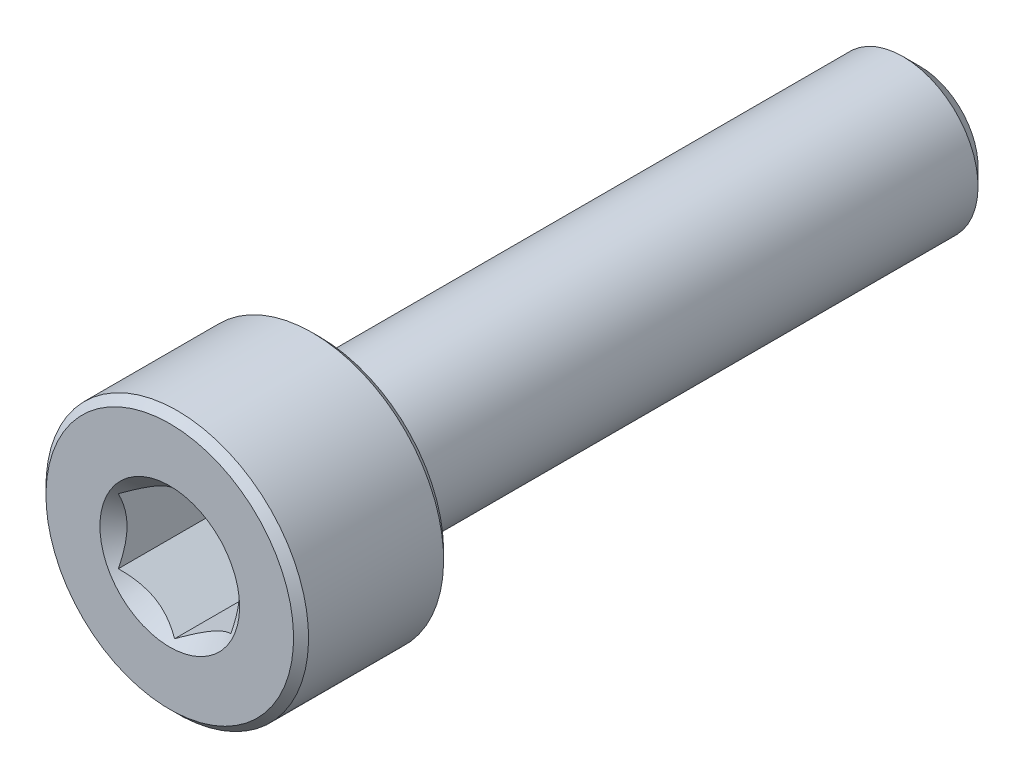
ISO-10303-21;
HEADER;
FILE_DESCRIPTION(('STEP AP214'),'2;1');
FILE_NAME('part.step','',(''),(''),'','','');
FILE_SCHEMA(('AUTOMOTIVE_DESIGN { 1 0 10303 214 1 1 1 1 }'));
ENDSEC;
DATA;
#1=APPLICATION_CONTEXT('core data for automotive mechanical design processes');
#2=APPLICATION_PROTOCOL_DEFINITION('international standard','automotive_design',2000,#1);
#3=PRODUCT_CONTEXT('',#1,'mechanical');
#4=PRODUCT('Part','Part','',(#3));
#5=PRODUCT_RELATED_PRODUCT_CATEGORY('part','',(#4));
#6=PRODUCT_DEFINITION_FORMATION('','',#4);
#7=PRODUCT_DEFINITION_CONTEXT('part definition',#1,'design');
#8=PRODUCT_DEFINITION('design','',#6,#7);
#9=PRODUCT_DEFINITION_SHAPE('','',#8);
#10=(LENGTH_UNIT() NAMED_UNIT(*) SI_UNIT(.MILLI.,.METRE.));
#11=(NAMED_UNIT(*) PLANE_ANGLE_UNIT() SI_UNIT($,.RADIAN.));
#12=(NAMED_UNIT(*) SI_UNIT($,.STERADIAN.) SOLID_ANGLE_UNIT());
#13=UNCERTAINTY_MEASURE_WITH_UNIT(LENGTH_MEASURE(1.E-05),#10,'distance_accuracy_value','');
#14=(GEOMETRIC_REPRESENTATION_CONTEXT(3) GLOBAL_UNCERTAINTY_ASSIGNED_CONTEXT((#13)) GLOBAL_UNIT_ASSIGNED_CONTEXT((#10,
#11,#12)) REPRESENTATION_CONTEXT('',''));
#15=CARTESIAN_POINT('',(0.,0.,0.));
#16=DIRECTION('',(0.,0.,1.));
#17=DIRECTION('',(1.,0.,0.));
#18=AXIS2_PLACEMENT_3D('',#15,#16,#17);
#19=CARTESIAN_POINT('',(0.,1.54533666301317,-10.));
#20=DIRECTION('',(0.,0.,-1.));
#21=DIRECTION('',(0.,1.,0.));
#22=AXIS2_PLACEMENT_3D('',#19,#20,#21);
#23=PLANE('',#22);
#24=CARTESIAN_POINT('',(0.,0.,-10.));
#25=DIRECTION('',(0.,0.,-1.));
#26=DIRECTION('',(0.,1.,0.));
#27=AXIS2_PLACEMENT_3D('',#24,#25,#26);
#28=CIRCLE('',#27,1.54533666301317);
#29=CARTESIAN_POINT('',(0.,1.54533666301317,-10.));
#30=VERTEX_POINT('',#29);
#31=EDGE_CURVE('E49',#30,#30,#28,.T.);
#32=ORIENTED_EDGE('',*,*,#31,.T.);
#33=EDGE_LOOP('',(#32));
#34=FACE_BOUND('',#33,.T.);
#35=ADVANCED_FACE('F36',(#34),#23,.T.);
#36=CARTESIAN_POINT('',(0.,0.,-10.));
#37=DIRECTION('',(0.,0.,1.));
#38=DIRECTION('',(0.,-1.,0.));
#39=AXIS2_PLACEMENT_3D('',#36,#37,#38);
#40=CONICAL_SURFACE('',#39,1.54533666301317,0.785398163397449);
#41=CARTESIAN_POINT('',(0.,0.,-9.54533666301317));
#42=DIRECTION('',(0.,0.,-1.));
#43=DIRECTION('',(0.,1.,0.));
#44=AXIS2_PLACEMENT_3D('',#41,#42,#43);
#45=CIRCLE('',#44,2.);
#46=CARTESIAN_POINT('',(0.,2.,-9.54533666301317));
#47=VERTEX_POINT('',#46);
#48=EDGE_CURVE('E152',#47,#47,#45,.T.);
#49=ORIENTED_EDGE('',*,*,#48,.T.);
#50=EDGE_LOOP('',(#49));
#51=FACE_BOUND('',#50,.T.);
#52=ORIENTED_EDGE('',*,*,#31,.F.);
#53=EDGE_LOOP('',(#52));
#54=FACE_BOUND('',#53,.T.);
#55=ADVANCED_FACE('F158',(#51,#54),#40,.T.);
#56=CARTESIAN_POINT('',(0.,0.,-10.));
#57=DIRECTION('',(0.,0.,-1.));
#58=DIRECTION('',(0.,1.,0.));
#59=AXIS2_PLACEMENT_3D('',#56,#57,#58);
#60=CYLINDRICAL_SURFACE('',#59,2.);
#61=CARTESIAN_POINT('',(0.,0.,5.8));
#62=DIRECTION('',(0.,0.,-1.));
#63=DIRECTION('',(0.,1.,0.));
#64=AXIS2_PLACEMENT_3D('',#61,#62,#63);
#65=CIRCLE('',#64,2.);
#66=CARTESIAN_POINT('',(0.,2.,5.8));
#67=VERTEX_POINT('',#66);
#68=EDGE_CURVE('E149',#67,#67,#65,.T.);
#69=ORIENTED_EDGE('',*,*,#68,.T.);
#70=EDGE_LOOP('',(#69));
#71=FACE_BOUND('',#70,.T.);
#72=ORIENTED_EDGE('',*,*,#48,.F.);
#73=EDGE_LOOP('',(#72));
#74=FACE_BOUND('',#73,.T.);
#75=ADVANCED_FACE('F160',(#71,#74),#60,.T.);
#76=CARTESIAN_POINT('',(0.,0.,5.8));
#77=DIRECTION('',(0.,0.,-1.));
#78=DIRECTION('',(0.,1.,0.));
#79=AXIS2_PLACEMENT_3D('',#76,#77,#78);
#80=TOROIDAL_SURFACE('',#79,2.2,0.2);
#81=CARTESIAN_POINT('',(0.,0.,6.));
#82=DIRECTION('',(0.,0.,-1.));
#83=DIRECTION('',(0.,1.,0.));
#84=AXIS2_PLACEMENT_3D('',#81,#82,#83);
#85=CIRCLE('',#84,2.2);
#86=CARTESIAN_POINT('',(0.,2.2,6.));
#87=VERTEX_POINT('',#86);
#88=EDGE_CURVE('E146',#87,#87,#85,.T.);
#89=ORIENTED_EDGE('',*,*,#88,.T.);
#90=EDGE_LOOP('',(#89));
#91=FACE_BOUND('',#90,.T.);
#92=ORIENTED_EDGE('',*,*,#68,.F.);
#93=EDGE_LOOP('',(#92));
#94=FACE_BOUND('',#93,.T.);
#95=ADVANCED_FACE('F166',(#91,#94),#80,.F.);
#96=CARTESIAN_POINT('',(0.,3.3,6.));
#97=DIRECTION('',(0.,0.,-1.));
#98=DIRECTION('',(0.,1.,0.));
#99=AXIS2_PLACEMENT_3D('',#96,#97,#98);
#100=PLANE('',#99);
#101=CARTESIAN_POINT('',(0.,0.,6.));
#102=DIRECTION('',(0.,0.,-1.));
#103=DIRECTION('',(0.,1.,0.));
#104=AXIS2_PLACEMENT_3D('',#101,#102,#103);
#105=CIRCLE('',#104,3.3);
#106=CARTESIAN_POINT('',(0.,3.3,6.));
#107=VERTEX_POINT('',#106);
#108=EDGE_CURVE('E143',#107,#107,#105,.T.);
#109=ORIENTED_EDGE('',*,*,#108,.T.);
#110=EDGE_LOOP('',(#109));
#111=FACE_BOUND('',#110,.T.);
#112=ORIENTED_EDGE('',*,*,#88,.F.);
#113=EDGE_LOOP('',(#112));
#114=FACE_BOUND('',#113,.T.);
#115=ADVANCED_FACE('F172',(#111,#114),#100,.T.);
#116=CARTESIAN_POINT('',(0.,0.,6.));
#117=DIRECTION('',(0.,0.,1.));
#118=DIRECTION('',(0.,-1.,0.));
#119=AXIS2_PLACEMENT_3D('',#116,#117,#118);
#120=CONICAL_SURFACE('',#119,3.3,0.785398163397452);
#121=CARTESIAN_POINT('',(0.,0.,6.2));
#122=DIRECTION('',(0.,0.,-1.));
#123=DIRECTION('',(0.,1.,0.));
#124=AXIS2_PLACEMENT_3D('',#121,#122,#123);
#125=CIRCLE('',#124,3.5);
#126=CARTESIAN_POINT('',(0.,3.5,6.2));
#127=VERTEX_POINT('',#126);
#128=EDGE_CURVE('E140',#127,#127,#125,.T.);
#129=ORIENTED_EDGE('',*,*,#128,.T.);
#130=EDGE_LOOP('',(#129));
#131=FACE_BOUND('',#130,.T.);
#132=ORIENTED_EDGE('',*,*,#108,.F.);
#133=EDGE_LOOP('',(#132));
#134=FACE_BOUND('',#133,.T.);
#135=ADVANCED_FACE('F176',(#131,#134),#120,.T.);
#136=CARTESIAN_POINT('',(0.,0.,-10.));
#137=DIRECTION('',(0.,0.,-1.));
#138=DIRECTION('',(0.,1.,0.));
#139=AXIS2_PLACEMENT_3D('',#136,#137,#138);
#140=CYLINDRICAL_SURFACE('',#139,3.5);
#141=CARTESIAN_POINT('',(0.,0.,9.8));
#142=DIRECTION('',(0.,0.,-1.));
#143=DIRECTION('',(0.,1.,0.));
#144=AXIS2_PLACEMENT_3D('',#141,#142,#143);
#145=CIRCLE('',#144,3.5);
#146=CARTESIAN_POINT('',(0.,3.5,9.8));
#147=VERTEX_POINT('',#146);
#148=EDGE_CURVE('E137',#147,#147,#145,.T.);
#149=ORIENTED_EDGE('',*,*,#148,.T.);
#150=EDGE_LOOP('',(#149));
#151=FACE_BOUND('',#150,.T.);
#152=ORIENTED_EDGE('',*,*,#128,.F.);
#153=EDGE_LOOP('',(#152));
#154=FACE_BOUND('',#153,.T.);
#155=ADVANCED_FACE('F180',(#151,#154),#140,.T.);
#156=CARTESIAN_POINT('',(0.,0.,9.8));
#157=DIRECTION('',(0.,0.,-1.));
#158=DIRECTION('',(0.,1.,0.));
#159=AXIS2_PLACEMENT_3D('',#156,#157,#158);
#160=CONICAL_SURFACE('',#159,3.5,0.785398163397443);
#161=CARTESIAN_POINT('',(0.,0.,10.));
#162=DIRECTION('',(0.,0.,-1.));
#163=DIRECTION('',(0.,1.,0.));
#164=AXIS2_PLACEMENT_3D('',#161,#162,#163);
#165=CIRCLE('',#164,3.3);
#166=CARTESIAN_POINT('',(0.,3.3,10.));
#167=VERTEX_POINT('',#166);
#168=EDGE_CURVE('E134',#167,#167,#165,.T.);
#169=ORIENTED_EDGE('',*,*,#168,.T.);
#170=EDGE_LOOP('',(#169));
#171=FACE_BOUND('',#170,.T.);
#172=ORIENTED_EDGE('',*,*,#148,.F.);
#173=EDGE_LOOP('',(#172));
#174=FACE_BOUND('',#173,.T.);
#175=ADVANCED_FACE('F184',(#171,#174),#160,.T.);
#176=CARTESIAN_POINT('',(0.,0.,10.));
#177=DIRECTION('',(0.,0.,1.));
#178=DIRECTION('',(0.,-1.,0.));
#179=AXIS2_PLACEMENT_3D('',#176,#177,#178);
#180=PLANE('',#179);
#181=CARTESIAN_POINT('',(0.,0.,10.));
#182=DIRECTION('',(0.,0.,1.));
#183=DIRECTION('',(1.,0.,0.));
#184=AXIS2_PLACEMENT_3D('',#181,#182,#183);
#185=CIRCLE('',#184,1.86195461813654);
#186=CARTESIAN_POINT('',(1.86195461813654,0.,10.));
#187=VERTEX_POINT('',#186);
#188=EDGE_CURVE('E108',#187,#187,#185,.T.);
#189=ORIENTED_EDGE('',*,*,#188,.F.);
#190=EDGE_LOOP('',(#189));
#191=FACE_BOUND('',#190,.T.);
#192=ORIENTED_EDGE('',*,*,#168,.F.);
#193=EDGE_LOOP('',(#192));
#194=FACE_BOUND('',#193,.T.);
#195=ADVANCED_FACE('F188',(#191,#194),#180,.T.);
#196=CARTESIAN_POINT('',(0.,0.,10.));
#197=DIRECTION('',(0.,0.,1.));
#198=DIRECTION('',(1.,0.,0.));
#199=AXIS2_PLACEMENT_3D('',#196,#197,#198);
#200=CONICAL_SURFACE('',#199,1.86195461813654,0.78539816339745);
#201=ORIENTED_EDGE('',*,*,#188,.T.);
#202=EDGE_LOOP('',(#201));
#203=FACE_BOUND('',#202,.T.);
#204=CARTESIAN_POINT('',(-0.000199999999999267,-1.73216627762272,9.87021167103241));
#205=CARTESIAN_POINT('',(0.051367790737076,-1.70239359975915,9.84046166549966));
#206=CARTESIAN_POINT('',(0.103797917665201,-1.67212305186355,9.81245867334265));
#207=CARTESIAN_POINT('',(0.210709034055597,-1.61039789003619,9.76118541987248));
#208=CARTESIAN_POINT('',(0.265200195814661,-1.57893740312614,9.73794369447671));
#209=CARTESIAN_POINT('',(0.375079081357248,-1.51549879897987,9.69812991842456));
#210=CARTESIAN_POINT('',(0.4304388090952,-1.4835368452681,9.68145777510323));
#211=CARTESIAN_POINT('',(0.542377257477151,-1.41890915196211,9.65577064625044));
#212=CARTESIAN_POINT('',(0.598952556553009,-1.38624538781118,9.6467364799112));
#213=CARTESIAN_POINT('',(0.696455389516441,-1.329952100953,9.63858527065919));
#214=CARTESIAN_POINT('',(0.737256908280466,-1.30639533311124,9.63737844242155));
#215=CARTESIAN_POINT('',(0.818787969615858,-1.25932335290193,9.6394102465946));
#216=CARTESIAN_POINT('',(0.85951749431463,-1.23580815085313,9.64264986018064));
#217=CARTESIAN_POINT('',(0.940584402163416,-1.18900414978427,9.6533881754143));
#218=CARTESIAN_POINT('',(0.980921384598287,-1.1657155821172,9.66089084245107));
#219=CARTESIAN_POINT('',(1.06091833691403,-1.11952932016335,9.67974780136063));
#220=CARTESIAN_POINT('',(1.10057800851621,-1.09663179808786,9.69110374645092));
#221=CARTESIAN_POINT('',(1.20216313477448,-1.03798159809698,9.72481783702501));
#222=CARTESIAN_POINT('',(1.26345855370969,-1.00259267147465,9.7497180385257));
#223=CARTESIAN_POINT('',(1.35358562846331,-0.950557780604375,9.79175284270391));
#224=CARTESIAN_POINT('',(1.38328513990772,-0.933410759677148,9.80652134299143));
#225=CARTESIAN_POINT('',(1.44213790138375,-0.899432101996407,9.8374067553725));
#226=CARTESIAN_POINT('',(1.47129140422064,-0.88260031928571,9.85352302355405));
#227=CARTESIAN_POINT('',(1.5002,-0.865909933730601,9.87021167103241));
#228=B_SPLINE_CURVE_WITH_KNOTS('',3,(#204,#205,#206,#207,#208,#209,#210,#211,#212,#213,#214,
#215,#216,#217,#218,#219,#220,#221,#222,#223,#224,#225,#226,#227),.UNSPECIFIED.,.F.,.F.,(4,2,2,
2,2,2,2,2,2,2,2,4),(0.,0.199829143693304,0.400822987382387,0.59862372053818,0.795926240188888,
0.93711306795988,1.07833105577193,1.21968061668222,1.36109089931054,1.58570969637565,
1.69770705470963,1.80965120737194),.UNSPECIFIED.);
#229=CARTESIAN_POINT('',(0.,-1.73205080756888,9.87009618943234));
#230=VERTEX_POINT('',#229);
#231=CARTESIAN_POINT('',(1.5,-0.866025403784439,9.87009618943233));
#232=VERTEX_POINT('',#231);
#233=EDGE_CURVE('E12',#230,#232,#228,.T.);
#234=ORIENTED_EDGE('',*,*,#233,.F.);
#235=CARTESIAN_POINT('',(-1.5002,-0.865909933730601,9.87021167103241));
#236=CARTESIAN_POINT('',(-1.44863220926292,-0.895682611594166,9.84046166549966));
#237=CARTESIAN_POINT('',(-1.3962020823348,-0.925953159489766,9.81245867334265));
#238=CARTESIAN_POINT('',(-1.2892909659444,-0.987678321317124,9.76118541987248));
#239=CARTESIAN_POINT('',(-1.23479980418534,-1.01913880822718,9.73794369447671));
#240=CARTESIAN_POINT('',(-1.12492091864275,-1.08257741237344,9.69812991842456));
#241=CARTESIAN_POINT('',(-1.0695611909048,-1.11453936608521,9.68145777510323));
#242=CARTESIAN_POINT('',(-0.95762274252285,-1.1791670593912,9.65577064625044));
#243=CARTESIAN_POINT('',(-0.901047443446992,-1.21183082354213,9.6467364799112));
#244=CARTESIAN_POINT('',(-0.80354461048356,-1.26812411040032,9.63858527065919));
#245=CARTESIAN_POINT('',(-0.762743091719534,-1.29168087824208,9.63737844242155));
#246=CARTESIAN_POINT('',(-0.681212030384142,-1.33875285845138,9.6394102465946));
#247=CARTESIAN_POINT('',(-0.640482505685371,-1.36226806050018,9.64264986018064));
#248=CARTESIAN_POINT('',(-0.559415597836584,-1.40907206156905,9.6533881754143));
#249=CARTESIAN_POINT('',(-0.519078615401712,-1.43236062923612,9.66089084245107));
#250=CARTESIAN_POINT('',(-0.439081663085969,-1.47854689118996,9.67974780136063));
#251=CARTESIAN_POINT('',(-0.399421991483793,-1.50144441326545,9.69110374645092));
#252=CARTESIAN_POINT('',(-0.297836865225515,-1.56009461325633,9.72481783702501));
#253=CARTESIAN_POINT('',(-0.236541446290311,-1.59548353987866,9.7497180385257));
#254=CARTESIAN_POINT('',(-0.146414371536687,-1.64751843074894,9.79175284270391));
#255=CARTESIAN_POINT('',(-0.116714860092283,-1.66466545167617,9.80652134299143));
#256=CARTESIAN_POINT('',(-0.0578620986162496,-1.69864410935691,9.8374067553725));
#257=CARTESIAN_POINT('',(-0.0287085957793628,-1.71547589206761,9.85352302355404));
#258=CARTESIAN_POINT('',(0.000200000000000409,-1.73216627762272,9.87021167103241));
#259=B_SPLINE_CURVE_WITH_KNOTS('',3,(#235,#236,#237,#238,#239,#240,#241,#242,#243,#244,#245,
#246,#247,#248,#249,#250,#251,#252,#253,#254,#255,#256,#257,#258),.UNSPECIFIED.,.F.,.F.,(4,2,2,
2,2,2,2,2,2,2,2,4),(0.,0.199829143693305,0.400822987382388,0.59862372053818,0.795926240188888,
0.93711306795988,1.07833105577193,1.21968061668222,1.36109089931054,1.58570969637565,
1.69770705470963,1.80965120737194),.UNSPECIFIED.);
#260=CARTESIAN_POINT('',(-1.5,-0.866025403784439,9.87009618943234));
#261=VERTEX_POINT('',#260);
#262=EDGE_CURVE('E94',#261,#230,#259,.T.);
#263=ORIENTED_EDGE('',*,*,#262,.F.);
#264=CARTESIAN_POINT('',(-1.5,-1.81798631684901,10.4949658829093));
#265=CARTESIAN_POINT('',(-1.5,-1.77410479833239,10.461123354197));
#266=CARTESIAN_POINT('',(-1.5,-1.72998897047494,10.427585617689));
#267=CARTESIAN_POINT('',(-1.5,-1.64119029432319,10.3612481734927));
#268=CARTESIAN_POINT('',(-1.5,-1.59650731534755,10.328448640911));
#269=CARTESIAN_POINT('',(-1.5,-1.460806940489,10.2308819314804));
#270=CARTESIAN_POINT('',(-1.5,-1.36880251235632,10.1674654206559));
#271=CARTESIAN_POINT('',(-1.5,-1.17526237686872,10.0421023717216));
#272=CARTESIAN_POINT('',(-1.5,-1.07349393006072,9.98051141536721));
#273=CARTESIAN_POINT('',(-1.5,-0.864764842560628,9.86725220599653));
#274=CARTESIAN_POINT('',(-1.5,-0.757823334449949,9.81555043950584));
#275=CARTESIAN_POINT('',(-1.5,-0.598146069886857,9.75227317361643));
#276=CARTESIAN_POINT('',(-1.5,-0.547969945491557,9.73427408399123));
#277=CARTESIAN_POINT('',(-1.5,-0.446326869364774,9.70229546522083));
#278=CARTESIAN_POINT('',(-1.5,-0.394859836419924,9.68831618966241));
#279=CARTESIAN_POINT('',(-1.5,-0.291848397493325,9.66536569037263));
#280=CARTESIAN_POINT('',(-1.5,-0.240324749628771,9.65630281543282));
#281=CARTESIAN_POINT('',(-1.5,-0.13662544851591,9.64337711521516));
#282=CARTESIAN_POINT('',(-1.5,-0.0844499362377801,9.6395131846234));
#283=CARTESIAN_POINT('',(-1.5,0.0176806967011131,9.63731961256892));
#284=CARTESIAN_POINT('',(-1.5,0.0676307045116618,9.63875006923659));
#285=CARTESIAN_POINT('',(-1.5,0.16714547763776,9.64651331423855));
#286=CARTESIAN_POINT('',(-1.5,0.216710207908513,9.6528465433779));
#287=CARTESIAN_POINT('',(-1.5,0.315937150651982,9.67016271707146));
#288=CARTESIAN_POINT('',(-1.5,0.365584733694539,9.68122815181031));
#289=CARTESIAN_POINT('',(-1.5,0.46378160619877,9.70739349919908));
#290=CARTESIAN_POINT('',(-1.5,0.512330953840259,9.72249319758548));
#291=CARTESIAN_POINT('',(-1.5,0.661313023287691,9.77461385569168));
#292=CARTESIAN_POINT('',(-1.5,0.759720789706277,9.81740496304236));
#293=CARTESIAN_POINT('',(-1.5,0.951942669022771,9.91263883721007));
#294=CARTESIAN_POINT('',(-1.5,1.04573912191844,9.96511552648595));
#295=CARTESIAN_POINT('',(-1.5,1.22504153577549,10.0734783373155));
#296=CARTESIAN_POINT('',(-1.5,1.3107282773288,10.1290691055441));
#297=CARTESIAN_POINT('',(-1.5,1.43696960041027,10.2150504562164));
#298=CARTESIAN_POINT('',(-1.5,1.47850725450332,10.2440226829709));
#299=CARTESIAN_POINT('',(-1.5,1.56101250374723,10.3027448839378));
#300=CARTESIAN_POINT('',(-1.5,1.60198025290925,10.3324946415183));
#301=CARTESIAN_POINT('',(-1.5,1.64271029717086,10.362567155286));
#302=B_SPLINE_CURVE_WITH_KNOTS('',3,(#264,#265,#266,#267,#268,#269,#270,#271,#272,#273,#274,
#275,#276,#277,#278,#279,#280,#281,#282,#283,#284,#285,#286,#287,#288,#289,#290,#291,#292,#293,
#294,#295,#296,#297,#298,#299,#300,#301),.UNSPECIFIED.,.F.,.F.,(4,2,2,2,2,2,2,2,2,2,2,2,2,2,2,2,
2,2,4),(0.,0.166243250325254,0.332525527595492,0.667617582874063,1.02421660314856,
1.37958485991002,1.53937185590113,1.69916892971772,1.85587466130012,2.01254707142443,
2.16220898927398,2.31188436469119,2.46428258498153,2.61667271286895,2.93766301623296,
3.25979964661299,3.56606529199603,3.71798989158865,3.86987260467919),.UNSPECIFIED.);
#303=CARTESIAN_POINT('',(-1.5,0.866025403784438,9.87009618943233));
#304=VERTEX_POINT('',#303);
#305=EDGE_CURVE('E107',#304,#261,#302,.F.);
#306=ORIENTED_EDGE('',*,*,#305,.F.);
#307=CARTESIAN_POINT('',(0.000199999999999471,1.73216627762272,9.87021167103241));
#308=CARTESIAN_POINT('',(-0.0513677907370758,1.70239359975915,9.84046166549966));
#309=CARTESIAN_POINT('',(-0.103797917665201,1.67212305186355,9.81245867334265));
#310=CARTESIAN_POINT('',(-0.210709034055596,1.61039789003619,9.76118541987248));
#311=CARTESIAN_POINT('',(-0.265200195814661,1.57893740312614,9.73794369447671));
#312=CARTESIAN_POINT('',(-0.375079081357249,1.51549879897987,9.69812991842456));
#313=CARTESIAN_POINT('',(-0.430438809095199,1.4835368452681,9.68145777510323));
#314=CARTESIAN_POINT('',(-0.54237725747715,1.41890915196211,9.65577064625044));
#315=CARTESIAN_POINT('',(-0.598952556553008,1.38624538781118,9.6467364799112));
#316=CARTESIAN_POINT('',(-0.69645538951644,1.329952100953,9.63858527065919));
#317=CARTESIAN_POINT('',(-0.737256908280465,1.30639533311124,9.63737844242155));
#318=CARTESIAN_POINT('',(-0.818787969615858,1.25932335290194,9.6394102465946));
#319=CARTESIAN_POINT('',(-0.859517494314629,1.23580815085313,9.64264986018064));
#320=CARTESIAN_POINT('',(-0.940584402163415,1.18900414978427,9.6533881754143));
#321=CARTESIAN_POINT('',(-0.980921384598287,1.1657155821172,9.66089084245107));
#322=CARTESIAN_POINT('',(-1.06091833691403,1.11952932016335,9.67974780136063));
#323=CARTESIAN_POINT('',(-1.10057800851621,1.09663179808786,9.69110374645092));
#324=CARTESIAN_POINT('',(-1.20216313477448,1.03798159809698,9.72481783702501));
#325=CARTESIAN_POINT('',(-1.26345855370969,1.00259267147465,9.7497180385257));
#326=CARTESIAN_POINT('',(-1.35358562846331,0.950557780604375,9.79175284270391));
#327=CARTESIAN_POINT('',(-1.38328513990772,0.933410759677148,9.80652134299143));
#328=CARTESIAN_POINT('',(-1.44213790138375,0.899432101996407,9.8374067553725));
#329=CARTESIAN_POINT('',(-1.47129140422064,0.88260031928571,9.85352302355405));
#330=CARTESIAN_POINT('',(-1.5002,0.8659099337306,9.87021167103241));
#331=B_SPLINE_CURVE_WITH_KNOTS('',3,(#307,#308,#309,#310,#311,#312,#313,#314,#315,#316,#317,
#318,#319,#320,#321,#322,#323,#324,#325,#326,#327,#328,#329,#330),.UNSPECIFIED.,.F.,.F.,(4,2,2,
2,2,2,2,2,2,2,2,4),(0.,0.199829143693304,0.400822987382388,0.59862372053818,0.795926240188888,
0.93711306795988,1.07833105577193,1.21968061668222,1.36109089931054,1.58570969637565,
1.69770705470964,1.80965120737194),.UNSPECIFIED.);
#332=CARTESIAN_POINT('',(0.,1.73205080756888,9.87009618943234));
#333=VERTEX_POINT('',#332);
#334=EDGE_CURVE('E238',#333,#304,#331,.T.);
#335=ORIENTED_EDGE('',*,*,#334,.F.);
#336=CARTESIAN_POINT('',(1.5002,0.865909933730601,9.87021167103241));
#337=CARTESIAN_POINT('',(1.44863220926292,0.895682611594166,9.84046166549966));
#338=CARTESIAN_POINT('',(1.3962020823348,0.925953159489765,9.81245867334265));
#339=CARTESIAN_POINT('',(1.2892909659444,0.987678321317124,9.76118541987248));
#340=CARTESIAN_POINT('',(1.23479980418534,1.01913880822718,9.73794369447671));
#341=CARTESIAN_POINT('',(1.12492091864275,1.08257741237344,9.69812991842456));
#342=CARTESIAN_POINT('',(1.0695611909048,1.11453936608521,9.68145777510323));
#343=CARTESIAN_POINT('',(0.957622742522849,1.1791670593912,9.65577064625044));
#344=CARTESIAN_POINT('',(0.901047443446991,1.21183082354213,9.6467364799112));
#345=CARTESIAN_POINT('',(0.803544610483559,1.26812411040032,9.63858527065919));
#346=CARTESIAN_POINT('',(0.762743091719534,1.29168087824208,9.63737844242155));
#347=CARTESIAN_POINT('',(0.681212030384142,1.33875285845138,9.6394102465946));
#348=CARTESIAN_POINT('',(0.64048250568537,1.36226806050018,9.64264986018064));
#349=CARTESIAN_POINT('',(0.559415597836584,1.40907206156905,9.6533881754143));
#350=CARTESIAN_POINT('',(0.519078615401712,1.43236062923612,9.66089084245107));
#351=CARTESIAN_POINT('',(0.439081663085969,1.47854689118996,9.67974780136063));
#352=CARTESIAN_POINT('',(0.399421991483792,1.50144441326545,9.69110374645092));
#353=CARTESIAN_POINT('',(0.297836865225515,1.56009461325633,9.72481783702501));
#354=CARTESIAN_POINT('',(0.236541446290311,1.59548353987866,9.7497180385257));
#355=CARTESIAN_POINT('',(0.146414371536686,1.64751843074894,9.79175284270391));
#356=CARTESIAN_POINT('',(0.116714860092282,1.66466545167617,9.80652134299143));
#357=CARTESIAN_POINT('',(0.0578620986162487,1.69864410935691,9.8374067553725));
#358=CARTESIAN_POINT('',(0.0287085957793626,1.71547589206761,9.85352302355404));
#359=CARTESIAN_POINT('',(-0.000200000000000123,1.73216627762272,9.87021167103241));
#360=B_SPLINE_CURVE_WITH_KNOTS('',3,(#336,#337,#338,#339,#340,#341,#342,#343,#344,#345,#346,
#347,#348,#349,#350,#351,#352,#353,#354,#355,#356,#357,#358,#359),.UNSPECIFIED.,.F.,.F.,(4,2,2,
2,2,2,2,2,2,2,2,4),(0.,0.199829143693305,0.400822987382389,0.598623720538181,0.795926240188889,
0.937113067959881,1.07833105577193,1.21968061668222,1.36109089931054,1.58570969637565,
1.69770705470964,1.80965120737194),.UNSPECIFIED.);
#361=CARTESIAN_POINT('',(1.5,0.866025403784439,9.87009618943234));
#362=VERTEX_POINT('',#361);
#363=EDGE_CURVE('E211',#362,#333,#360,.T.);
#364=ORIENTED_EDGE('',*,*,#363,.F.);
#365=CARTESIAN_POINT('',(1.5,-1.81798631684901,10.4949658829093));
#366=CARTESIAN_POINT('',(1.5,-1.77410479833239,10.461123354197));
#367=CARTESIAN_POINT('',(1.5,-1.72998897047494,10.427585617689));
#368=CARTESIAN_POINT('',(1.5,-1.64119029432319,10.3612481734927));
#369=CARTESIAN_POINT('',(1.5,-1.59650731534755,10.328448640911));
#370=CARTESIAN_POINT('',(1.5,-1.460806940489,10.2308819314804));
#371=CARTESIAN_POINT('',(1.5,-1.36880251235632,10.1674654206559));
#372=CARTESIAN_POINT('',(1.5,-1.17526237686872,10.0421023717216));
#373=CARTESIAN_POINT('',(1.5,-1.07349393006072,9.98051141536721));
#374=CARTESIAN_POINT('',(1.5,-0.864764842560628,9.86725220599653));
#375=CARTESIAN_POINT('',(1.5,-0.757823334449949,9.81555043950584));
#376=CARTESIAN_POINT('',(1.5,-0.598146069886857,9.75227317361643));
#377=CARTESIAN_POINT('',(1.5,-0.547969945491556,9.73427408399123));
#378=CARTESIAN_POINT('',(1.5,-0.446326869364774,9.70229546522083));
#379=CARTESIAN_POINT('',(1.5,-0.394859836419924,9.68831618966241));
#380=CARTESIAN_POINT('',(1.5,-0.291848397493325,9.66536569037263));
#381=CARTESIAN_POINT('',(1.5,-0.240324749628771,9.65630281543282));
#382=CARTESIAN_POINT('',(1.5,-0.13662544851591,9.64337711521516));
#383=CARTESIAN_POINT('',(1.5,-0.0844499362377798,9.6395131846234));
#384=CARTESIAN_POINT('',(1.5,0.0176806967011132,9.63731961256892));
#385=CARTESIAN_POINT('',(1.5,0.0676307045116619,9.63875006923659));
#386=CARTESIAN_POINT('',(1.5,0.16714547763776,9.64651331423855));
#387=CARTESIAN_POINT('',(1.5,0.216710207908513,9.6528465433779));
#388=CARTESIAN_POINT('',(1.5,0.315937150651982,9.67016271707146));
#389=CARTESIAN_POINT('',(1.5,0.365584733694539,9.68122815181031));
#390=CARTESIAN_POINT('',(1.5,0.46378160619877,9.70739349919908));
#391=CARTESIAN_POINT('',(1.5,0.512330953840259,9.72249319758548));
#392=CARTESIAN_POINT('',(1.5,0.661313023287691,9.77461385569168));
#393=CARTESIAN_POINT('',(1.5,0.759720789706278,9.81740496304236));
#394=CARTESIAN_POINT('',(1.5,0.951942669022771,9.91263883721007));
#395=CARTESIAN_POINT('',(1.5,1.04573912191844,9.96511552648595));
#396=CARTESIAN_POINT('',(1.5,1.22504153577549,10.0734783373155));
#397=CARTESIAN_POINT('',(1.5,1.3107282773288,10.1290691055441));
#398=CARTESIAN_POINT('',(1.5,1.43696960041027,10.2150504562164));
#399=CARTESIAN_POINT('',(1.5,1.47850725450332,10.2440226829709));
#400=CARTESIAN_POINT('',(1.5,1.56101250374723,10.3027448839378));
#401=CARTESIAN_POINT('',(1.5,1.60198025290925,10.3324946415183));
#402=CARTESIAN_POINT('',(1.5,1.64271029717086,10.362567155286));
#403=B_SPLINE_CURVE_WITH_KNOTS('',3,(#365,#366,#367,#368,#369,#370,#371,#372,#373,#374,#375,
#376,#377,#378,#379,#380,#381,#382,#383,#384,#385,#386,#387,#388,#389,#390,#391,#392,#393,#394,
#395,#396,#397,#398,#399,#400,#401,#402),.UNSPECIFIED.,.F.,.F.,(4,2,2,2,2,2,2,2,2,2,2,2,2,2,2,2,
2,2,4),(0.,0.166243250325254,0.332525527595492,0.667617582874063,1.02421660314856,
1.37958485991002,1.53937185590113,1.69916892971772,1.85587466130012,2.01254707142443,
2.16220898927398,2.31188436469119,2.46428258498153,2.61667271286895,2.93766301623296,
3.25979964661299,3.56606529199603,3.71798989158865,3.86987260467919),.UNSPECIFIED.);
#404=EDGE_CURVE('E56',#232,#362,#403,.T.);
#405=ORIENTED_EDGE('',*,*,#404,.F.);
#406=EDGE_LOOP('',(#234,#263,#306,#335,#364,#405));
#407=FACE_BOUND('',#406,.T.);
#408=ADVANCED_FACE('F93',(#203,#407),#200,.F.);
#409=CARTESIAN_POINT('',(0.,3.3,7.));
#410=DIRECTION('',(0.,0.,-1.));
#411=DIRECTION('',(0.,1.,0.));
#412=AXIS2_PLACEMENT_3D('',#409,#410,#411);
#413=PLANE('',#412);
#414=DIRECTION('',(0.866025403784438,0.5,0.));
#415=VECTOR('',#414,1.);
#416=CARTESIAN_POINT('',(0.,-1.73205080756888,7.));
#417=LINE('',#416,#415);
#418=CARTESIAN_POINT('',(0.,-1.73205080756888,7.));
#419=VERTEX_POINT('',#418);
#420=CARTESIAN_POINT('',(1.5,-0.866025403784439,7.));
#421=VERTEX_POINT('',#420);
#422=EDGE_CURVE('E111',#419,#421,#417,.T.);
#423=ORIENTED_EDGE('',*,*,#422,.T.);
#424=DIRECTION('',(0.,1.,0.));
#425=VECTOR('',#424,1.);
#426=CARTESIAN_POINT('',(1.5,-0.866025403784439,7.));
#427=LINE('',#426,#425);
#428=CARTESIAN_POINT('',(1.5,0.866025403784439,7.));
#429=VERTEX_POINT('',#428);
#430=EDGE_CURVE('E63',#421,#429,#427,.T.);
#431=ORIENTED_EDGE('',*,*,#430,.T.);
#432=DIRECTION('',(-0.866025403784439,0.5,0.));
#433=VECTOR('',#432,1.);
#434=CARTESIAN_POINT('',(1.5,0.866025403784439,7.));
#435=LINE('',#434,#433);
#436=CARTESIAN_POINT('',(0.,1.73205080756888,7.));
#437=VERTEX_POINT('',#436);
#438=EDGE_CURVE('E119',#429,#437,#435,.T.);
#439=ORIENTED_EDGE('',*,*,#438,.T.);
#440=DIRECTION('',(-0.866025403784439,-0.5,0.));
#441=VECTOR('',#440,1.);
#442=CARTESIAN_POINT('',(0.,1.73205080756888,7.));
#443=LINE('',#442,#441);
#444=CARTESIAN_POINT('',(-1.5,0.866025403784439,7.));
#445=VERTEX_POINT('',#444);
#446=EDGE_CURVE('E126',#437,#445,#443,.T.);
#447=ORIENTED_EDGE('',*,*,#446,.T.);
#448=DIRECTION('',(0.,-1.,0.));
#449=VECTOR('',#448,1.);
#450=CARTESIAN_POINT('',(-1.5,0.866025403784438,7.));
#451=LINE('',#450,#449);
#452=CARTESIAN_POINT('',(-1.5,-0.866025403784439,7.));
#453=VERTEX_POINT('',#452);
#454=EDGE_CURVE('E122',#445,#453,#451,.T.);
#455=ORIENTED_EDGE('',*,*,#454,.T.);
#456=DIRECTION('',(0.866025403784439,-0.5,0.));
#457=VECTOR('',#456,1.);
#458=CARTESIAN_POINT('',(-1.5,-0.866025403784439,7.));
#459=LINE('',#458,#457);
#460=EDGE_CURVE('E112',#453,#419,#459,.T.);
#461=ORIENTED_EDGE('',*,*,#460,.T.);
#462=EDGE_LOOP('',(#423,#431,#439,#447,#455,#461));
#463=FACE_BOUND('',#462,.T.);
#464=ADVANCED_FACE('F193',(#463),#413,.F.);
#465=CARTESIAN_POINT('',(0.,-1.73205080756888,1.41742430504416));
#466=DIRECTION('',(0.5,-0.866025403784438,0.));
#467=DIRECTION('',(0.866025403784438,0.5,0.));
#468=AXIS2_PLACEMENT_3D('',#465,#466,#467);
#469=PLANE('',#468);
#470=DIRECTION('',(0.,0.,1.));
#471=VECTOR('',#470,1.);
#472=CARTESIAN_POINT('',(0.,-1.73205080756888,1.41742430504416));
#473=LINE('',#472,#471);
#474=EDGE_CURVE('E103',#419,#230,#473,.T.);
#475=ORIENTED_EDGE('',*,*,#474,.T.);
#476=ORIENTED_EDGE('',*,*,#233,.T.);
#477=DIRECTION('',(0.,0.,1.));
#478=VECTOR('',#477,1.);
#479=CARTESIAN_POINT('',(1.5,-0.866025403784439,1.41742430504416));
#480=LINE('',#479,#478);
#481=EDGE_CURVE('E114',#421,#232,#480,.T.);
#482=ORIENTED_EDGE('',*,*,#481,.F.);
#483=ORIENTED_EDGE('',*,*,#422,.F.);
#484=EDGE_LOOP('',(#475,#476,#482,#483));
#485=FACE_BOUND('',#484,.T.);
#486=ADVANCED_FACE('F110',(#485),#469,.F.);
#487=CARTESIAN_POINT('',(-1.5,-0.866025403784439,1.41742430504416));
#488=DIRECTION('',(-0.5,-0.866025403784439,0.));
#489=DIRECTION('',(0.866025403784439,-0.5,0.));
#490=AXIS2_PLACEMENT_3D('',#487,#488,#489);
#491=PLANE('',#490);
#492=DIRECTION('',(0.,0.,1.));
#493=VECTOR('',#492,1.);
#494=CARTESIAN_POINT('',(-1.5,-0.866025403784439,1.41742430504416));
#495=LINE('',#494,#493);
#496=EDGE_CURVE('E106',#453,#261,#495,.T.);
#497=ORIENTED_EDGE('',*,*,#496,.T.);
#498=ORIENTED_EDGE('',*,*,#262,.T.);
#499=ORIENTED_EDGE('',*,*,#474,.F.);
#500=ORIENTED_EDGE('',*,*,#460,.F.);
#501=EDGE_LOOP('',(#497,#498,#499,#500));
#502=FACE_BOUND('',#501,.T.);
#503=ADVANCED_FACE('F102',(#502),#491,.F.);
#504=CARTESIAN_POINT('',(-1.5,0.866025403784438,1.41742430504416));
#505=DIRECTION('',(-1.,0.,0.));
#506=DIRECTION('',(0.,0.,1.));
#507=AXIS2_PLACEMENT_3D('',#504,#505,#506);
#508=PLANE('',#507);
#509=DIRECTION('',(0.,0.,1.));
#510=VECTOR('',#509,1.);
#511=CARTESIAN_POINT('',(-1.5,0.866025403784438,1.41742430504416));
#512=LINE('',#511,#510);
#513=EDGE_CURVE('E123',#445,#304,#512,.T.);
#514=ORIENTED_EDGE('',*,*,#513,.T.);
#515=ORIENTED_EDGE('',*,*,#305,.T.);
#516=ORIENTED_EDGE('',*,*,#496,.F.);
#517=ORIENTED_EDGE('',*,*,#454,.F.);
#518=EDGE_LOOP('',(#514,#515,#516,#517));
#519=FACE_BOUND('',#518,.T.);
#520=ADVANCED_FACE('F247',(#519),#508,.F.);
#521=CARTESIAN_POINT('',(0.,1.73205080756888,1.41742430504416));
#522=DIRECTION('',(-0.5,0.866025403784438,0.));
#523=DIRECTION('',(-0.866025403784439,-0.5,0.));
#524=AXIS2_PLACEMENT_3D('',#521,#522,#523);
#525=PLANE('',#524);
#526=DIRECTION('',(0.,0.,1.));
#527=VECTOR('',#526,1.);
#528=CARTESIAN_POINT('',(0.,1.73205080756888,1.41742430504416));
#529=LINE('',#528,#527);
#530=EDGE_CURVE('E127',#437,#333,#529,.T.);
#531=ORIENTED_EDGE('',*,*,#530,.T.);
#532=ORIENTED_EDGE('',*,*,#334,.T.);
#533=ORIENTED_EDGE('',*,*,#513,.F.);
#534=ORIENTED_EDGE('',*,*,#446,.F.);
#535=EDGE_LOOP('',(#531,#532,#533,#534));
#536=FACE_BOUND('',#535,.T.);
#537=ADVANCED_FACE('F244',(#536),#525,.F.);
#538=CARTESIAN_POINT('',(1.5,0.866025403784439,1.41742430504416));
#539=DIRECTION('',(0.5,0.866025403784439,0.));
#540=DIRECTION('',(-0.866025403784439,0.5,0.));
#541=AXIS2_PLACEMENT_3D('',#538,#539,#540);
#542=PLANE('',#541);
#543=DIRECTION('',(0.,0.,1.));
#544=VECTOR('',#543,1.);
#545=CARTESIAN_POINT('',(1.5,0.866025403784439,1.41742430504416));
#546=LINE('',#545,#544);
#547=EDGE_CURVE('E130',#429,#362,#546,.T.);
#548=ORIENTED_EDGE('',*,*,#547,.T.);
#549=ORIENTED_EDGE('',*,*,#363,.T.);
#550=ORIENTED_EDGE('',*,*,#530,.F.);
#551=ORIENTED_EDGE('',*,*,#438,.F.);
#552=EDGE_LOOP('',(#548,#549,#550,#551));
#553=FACE_BOUND('',#552,.T.);
#554=ADVANCED_FACE('F201',(#553),#542,.F.);
#555=CARTESIAN_POINT('',(1.5,-0.866025403784439,1.41742430504416));
#556=DIRECTION('',(1.,0.,0.));
#557=DIRECTION('',(0.,0.,-1.));
#558=AXIS2_PLACEMENT_3D('',#555,#556,#557);
#559=PLANE('',#558);
#560=ORIENTED_EDGE('',*,*,#481,.T.);
#561=ORIENTED_EDGE('',*,*,#404,.T.);
#562=ORIENTED_EDGE('',*,*,#547,.F.);
#563=ORIENTED_EDGE('',*,*,#430,.F.);
#564=EDGE_LOOP('',(#560,#561,#562,#563));
#565=FACE_BOUND('',#564,.T.);
#566=ADVANCED_FACE('F197',(#565),#559,.F.);
#567=CLOSED_SHELL('',(#35,#55,#75,#95,#115,#135,#155,#175,#195,#408,#464,#486,#503,#520,#537,
#554,#566));
#568=MANIFOLD_SOLID_BREP('B2',#567);
#569=ADVANCED_BREP_SHAPE_REPRESENTATION('',(#18,#568),#14);
#570=SHAPE_DEFINITION_REPRESENTATION(#9,#569);
ENDSEC;
END-ISO-10303-21;
